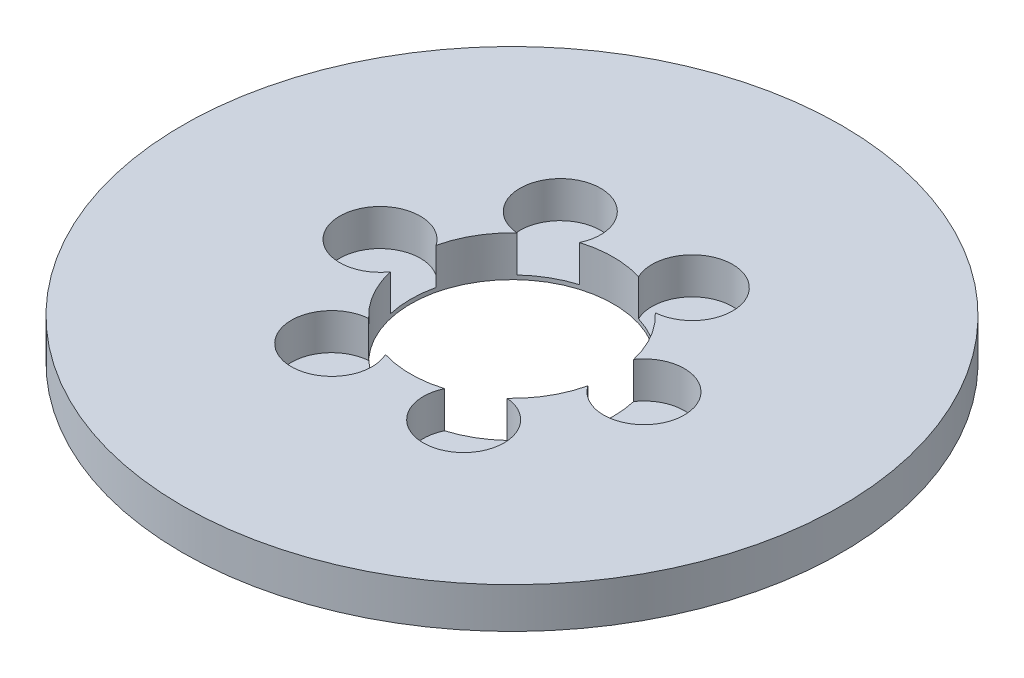
ISO-10303-21;
HEADER;
FILE_DESCRIPTION(('STEP AP214'),'2;1');
FILE_NAME('part.step','',(''),(''),'','','');
FILE_SCHEMA(('AUTOMOTIVE_DESIGN { 1 0 10303 214 1 1 1 1 }'));
ENDSEC;
DATA;
#1=APPLICATION_CONTEXT('core data for automotive mechanical design processes');
#2=APPLICATION_PROTOCOL_DEFINITION('international standard','automotive_design',2000,#1);
#3=PRODUCT_CONTEXT('',#1,'mechanical');
#4=PRODUCT('Part','Part','',(#3));
#5=PRODUCT_RELATED_PRODUCT_CATEGORY('part','',(#4));
#6=PRODUCT_DEFINITION_FORMATION('','',#4);
#7=PRODUCT_DEFINITION_CONTEXT('part definition',#1,'design');
#8=PRODUCT_DEFINITION('design','',#6,#7);
#9=PRODUCT_DEFINITION_SHAPE('','',#8);
#10=(LENGTH_UNIT() NAMED_UNIT(*) SI_UNIT(.MILLI.,.METRE.));
#11=(NAMED_UNIT(*) PLANE_ANGLE_UNIT() SI_UNIT($,.RADIAN.));
#12=(NAMED_UNIT(*) SI_UNIT($,.STERADIAN.) SOLID_ANGLE_UNIT());
#13=UNCERTAINTY_MEASURE_WITH_UNIT(LENGTH_MEASURE(1.E-05),#10,'distance_accuracy_value','');
#14=(GEOMETRIC_REPRESENTATION_CONTEXT(3) GLOBAL_UNCERTAINTY_ASSIGNED_CONTEXT((#13)) GLOBAL_UNIT_ASSIGNED_CONTEXT((#10,
#11,#12)) REPRESENTATION_CONTEXT('',''));
#15=CARTESIAN_POINT('',(0.,0.,0.));
#16=DIRECTION('',(0.,0.,1.));
#17=DIRECTION('',(1.,0.,0.));
#18=AXIS2_PLACEMENT_3D('',#15,#16,#17);
#19=CARTESIAN_POINT('',(0.,4.,0.));
#20=DIRECTION('',(0.,-1.,0.));
#21=DIRECTION('',(0.,0.,-1.));
#22=AXIS2_PLACEMENT_3D('',#19,#20,#21);
#23=CYLINDRICAL_SURFACE('',#22,32.5);
#24=CARTESIAN_POINT('',(0.,4.,0.));
#25=DIRECTION('',(0.,1.,0.));
#26=DIRECTION('',(0.,0.,1.));
#27=AXIS2_PLACEMENT_3D('',#24,#25,#26);
#28=CIRCLE('',#27,32.5);
#29=CARTESIAN_POINT('',(0.,4.,32.5));
#30=VERTEX_POINT('',#29);
#31=EDGE_CURVE('E171',#30,#30,#28,.T.);
#32=ORIENTED_EDGE('',*,*,#31,.F.);
#33=EDGE_LOOP('',(#32));
#34=FACE_BOUND('',#33,.T.);
#35=CARTESIAN_POINT('',(0.,0.,0.));
#36=DIRECTION('',(0.,1.,0.));
#37=DIRECTION('',(0.,0.,1.));
#38=AXIS2_PLACEMENT_3D('',#35,#36,#37);
#39=CIRCLE('',#38,32.5);
#40=CARTESIAN_POINT('',(0.,0.,32.5));
#41=VERTEX_POINT('',#40);
#42=EDGE_CURVE('E157',#41,#41,#39,.T.);
#43=ORIENTED_EDGE('',*,*,#42,.T.);
#44=EDGE_LOOP('',(#43));
#45=FACE_BOUND('',#44,.T.);
#46=ADVANCED_FACE('F39',(#34,#45),#23,.T.);
#47=CARTESIAN_POINT('',(0.,4.,0.));
#48=DIRECTION('',(0.,1.,0.));
#49=DIRECTION('',(0.,0.,1.));
#50=AXIS2_PLACEMENT_3D('',#47,#48,#49);
#51=PLANE('',#50);
#52=CARTESIAN_POINT('',(-6.50778404196415,4.,-11.2718126053675));
#53=DIRECTION('',(0.,1.,0.));
#54=DIRECTION('',(-0.866025403784433,0.,0.50000000000001));
#55=AXIS2_PLACEMENT_3D('',#52,#53,#54);
#56=CIRCLE('',#55,3.97783235547569);
#57=CARTESIAN_POINT('',(-2.91430675576737,4.,-9.56591951321402));
#58=VERTEX_POINT('',#57);
#59=CARTESIAN_POINT('',(-6.8271759311171,4.,-7.306823441522));
#60=VERTEX_POINT('',#59);
#61=EDGE_CURVE('E214',#58,#60,#56,.T.);
#62=ORIENTED_EDGE('',*,*,#61,.F.);
#63=CARTESIAN_POINT('',(0.,4.,0.));
#64=DIRECTION('',(0.,1.,0.));
#65=DIRECTION('',(0.,0.,1.));
#66=AXIS2_PLACEMENT_3D('',#63,#64,#65);
#67=CIRCLE('',#66,10.);
#68=CARTESIAN_POINT('',(2.91430675576717,4.,-9.56591951321408));
#69=VERTEX_POINT('',#68);
#70=EDGE_CURVE('E272',#69,#58,#67,.T.);
#71=ORIENTED_EDGE('',*,*,#70,.F.);
#72=CARTESIAN_POINT('',(6.50778404196391,4.,-11.2718126053677));
#73=DIRECTION('',(0.,1.,0.));
#74=DIRECTION('',(-0.866025403784443,0.,-0.499999999999992));
#75=AXIS2_PLACEMENT_3D('',#72,#73,#74);
#76=CIRCLE('',#75,3.97783235547569);
#77=CARTESIAN_POINT('',(6.82717593111694,4.,-7.30682344152214));
#78=VERTEX_POINT('',#77);
#79=EDGE_CURVE('E285',#78,#69,#76,.T.);
#80=ORIENTED_EDGE('',*,*,#79,.F.);
#81=CARTESIAN_POINT('',(9.74148268688427,4.,-2.25909607169197));
#82=VERTEX_POINT('',#81);
#83=EDGE_CURVE('E165',#82,#78,#67,.T.);
#84=ORIENTED_EDGE('',*,*,#83,.F.);
#85=CARTESIAN_POINT('',(13.015568083928,4.,0.));
#86=DIRECTION('',(0.,1.,0.));
#87=DIRECTION('',(0.,0.,-1.));
#88=AXIS2_PLACEMENT_3D('',#85,#86,#87);
#89=CIRCLE('',#88,3.97783235547569);
#90=CARTESIAN_POINT('',(9.74148268688427,4.,2.25909607169197));
#91=VERTEX_POINT('',#90);
#92=EDGE_CURVE('E281',#91,#82,#89,.T.);
#93=ORIENTED_EDGE('',*,*,#92,.F.);
#94=CARTESIAN_POINT('',(6.82717593111704,4.,7.30682344152205));
#95=VERTEX_POINT('',#94);
#96=EDGE_CURVE('E160',#95,#91,#67,.T.);
#97=ORIENTED_EDGE('',*,*,#96,.F.);
#98=CARTESIAN_POINT('',(6.50778404196407,4.,11.2718126053676));
#99=DIRECTION('',(0.,1.,0.));
#100=DIRECTION('',(0.866025403784436,0.,-0.500000000000004));
#101=AXIS2_PLACEMENT_3D('',#98,#99,#100);
#102=CIRCLE('',#101,3.97783235547569);
#103=CARTESIAN_POINT('',(2.9143067557673,4.,9.56591951321404));
#104=VERTEX_POINT('',#103);
#105=EDGE_CURVE('E154',#104,#95,#102,.T.);
#106=ORIENTED_EDGE('',*,*,#105,.F.);
#107=CARTESIAN_POINT('',(-2.91430675576723,4.,9.56591951321406));
#108=VERTEX_POINT('',#107);
#109=EDGE_CURVE('E150',#108,#104,#67,.T.);
#110=ORIENTED_EDGE('',*,*,#109,.F.);
#111=CARTESIAN_POINT('',(-6.50778404196399,4.,11.2718126053676));
#112=DIRECTION('',(0.,1.,0.));
#113=DIRECTION('',(0.86602540378444,0.,0.499999999999998));
#114=AXIS2_PLACEMENT_3D('',#111,#112,#113);
#115=CIRCLE('',#114,3.97783235547569);
#116=CARTESIAN_POINT('',(-6.82717593111699,4.,7.3068234415221));
#117=VERTEX_POINT('',#116);
#118=EDGE_CURVE('E127',#117,#108,#115,.T.);
#119=ORIENTED_EDGE('',*,*,#118,.F.);
#120=CARTESIAN_POINT('',(-9.74148268688427,4.,2.25909607169197));
#121=VERTEX_POINT('',#120);
#122=EDGE_CURVE('E156',#121,#117,#67,.T.);
#123=ORIENTED_EDGE('',*,*,#122,.F.);
#124=CARTESIAN_POINT('',(-13.015568083928,4.,0.));
#125=DIRECTION('',(0.,1.,0.));
#126=DIRECTION('',(0.,0.,1.));
#127=AXIS2_PLACEMENT_3D('',#124,#125,#126);
#128=CIRCLE('',#127,3.97783235547569);
#129=CARTESIAN_POINT('',(-9.74148268688427,4.,-2.25909607169197));
#130=VERTEX_POINT('',#129);
#131=EDGE_CURVE('E164',#130,#121,#128,.T.);
#132=ORIENTED_EDGE('',*,*,#131,.F.);
#133=EDGE_CURVE('E159',#60,#130,#67,.T.);
#134=ORIENTED_EDGE('',*,*,#133,.F.);
#135=EDGE_LOOP('',(#62,#71,#80,#84,#93,#97,#106,#110,#119,#123,#132,#134));
#136=FACE_BOUND('',#135,.T.);
#137=ORIENTED_EDGE('',*,*,#31,.T.);
#138=EDGE_LOOP('',(#137));
#139=FACE_BOUND('',#138,.T.);
#140=ADVANCED_FACE('F155',(#136,#139),#51,.T.);
#141=CARTESIAN_POINT('',(0.,0.,0.));
#142=DIRECTION('',(0.,1.,0.));
#143=DIRECTION('',(0.,0.,1.));
#144=AXIS2_PLACEMENT_3D('',#141,#142,#143);
#145=PLANE('',#144);
#146=CARTESIAN_POINT('',(0.,0.,0.));
#147=DIRECTION('',(0.,1.,0.));
#148=DIRECTION('',(0.,0.,1.));
#149=AXIS2_PLACEMENT_3D('',#146,#147,#148);
#150=CIRCLE('',#149,10.);
#151=CARTESIAN_POINT('',(0.,0.,10.));
#152=VERTEX_POINT('',#151);
#153=EDGE_CURVE('E170',#152,#152,#150,.T.);
#154=ORIENTED_EDGE('',*,*,#153,.T.);
#155=EDGE_LOOP('',(#154));
#156=FACE_BOUND('',#155,.T.);
#157=ORIENTED_EDGE('',*,*,#42,.F.);
#158=EDGE_LOOP('',(#157));
#159=FACE_BOUND('',#158,.T.);
#160=ADVANCED_FACE('F232',(#156,#159),#145,.F.);
#161=CARTESIAN_POINT('',(0.,4.,0.));
#162=DIRECTION('',(0.,-1.,0.));
#163=DIRECTION('',(0.,0.,-1.));
#164=AXIS2_PLACEMENT_3D('',#161,#162,#163);
#165=CYLINDRICAL_SURFACE('',#164,10.);
#166=DIRECTION('',(0.,1.,0.));
#167=VECTOR('',#166,1.);
#168=CARTESIAN_POINT('',(-2.91430675576737,2.20142956148121,-9.56591951321402));
#169=LINE('',#168,#167);
#170=CARTESIAN_POINT('',(-2.91430675576737,0.402859122962412,-9.56591951321402));
#171=VERTEX_POINT('',#170);
#172=EDGE_CURVE('E11',#171,#58,#169,.T.);
#173=ORIENTED_EDGE('',*,*,#172,.F.);
#174=CARTESIAN_POINT('',(0.,0.402859122962412,0.));
#175=DIRECTION('',(0.,1.,0.));
#176=DIRECTION('',(0.,0.,1.));
#177=AXIS2_PLACEMENT_3D('',#174,#175,#176);
#178=CIRCLE('',#177,10.);
#179=CARTESIAN_POINT('',(-6.8271759311171,0.402859122962412,-7.306823441522));
#180=VERTEX_POINT('',#179);
#181=EDGE_CURVE('E209',#171,#180,#178,.T.);
#182=ORIENTED_EDGE('',*,*,#181,.T.);
#183=DIRECTION('',(0.,1.,0.));
#184=VECTOR('',#183,1.);
#185=CARTESIAN_POINT('',(-6.82717593111709,2.20142956148121,-7.306823441522));
#186=LINE('',#185,#184);
#187=EDGE_CURVE('E46',#60,#180,#186,.F.);
#188=ORIENTED_EDGE('',*,*,#187,.F.);
#189=ORIENTED_EDGE('',*,*,#133,.T.);
#190=DIRECTION('',(0.,1.,0.));
#191=VECTOR('',#190,1.);
#192=CARTESIAN_POINT('',(-9.74148268688427,2.20142956148121,-2.25909607169197));
#193=LINE('',#192,#191);
#194=CARTESIAN_POINT('',(-9.74148268688427,0.402859122962412,-2.25909607169197));
#195=VERTEX_POINT('',#194);
#196=EDGE_CURVE('E185',#195,#130,#193,.T.);
#197=ORIENTED_EDGE('',*,*,#196,.F.);
#198=CARTESIAN_POINT('',(0.,0.402859122962412,0.));
#199=DIRECTION('',(0.,1.,0.));
#200=DIRECTION('',(0.,0.,1.));
#201=AXIS2_PLACEMENT_3D('',#198,#199,#200);
#202=CIRCLE('',#201,10.);
#203=CARTESIAN_POINT('',(-9.74148268688427,0.402859122962412,2.25909607169197));
#204=VERTEX_POINT('',#203);
#205=EDGE_CURVE('E173',#195,#204,#202,.T.);
#206=ORIENTED_EDGE('',*,*,#205,.T.);
#207=DIRECTION('',(0.,1.,0.));
#208=VECTOR('',#207,1.);
#209=CARTESIAN_POINT('',(-9.74148268688427,2.20142956148121,2.25909607169197));
#210=LINE('',#209,#208);
#211=EDGE_CURVE('E178',#121,#204,#210,.F.);
#212=ORIENTED_EDGE('',*,*,#211,.F.);
#213=ORIENTED_EDGE('',*,*,#122,.T.);
#214=DIRECTION('',(0.,1.,0.));
#215=VECTOR('',#214,1.);
#216=CARTESIAN_POINT('',(-6.82717593111699,2.20142956148121,7.3068234415221));
#217=LINE('',#216,#215);
#218=CARTESIAN_POINT('',(-6.82717593111699,0.402859122962412,7.3068234415221));
#219=VERTEX_POINT('',#218);
#220=EDGE_CURVE('E132',#219,#117,#217,.T.);
#221=ORIENTED_EDGE('',*,*,#220,.F.);
#222=CARTESIAN_POINT('',(0.,0.402859122962412,0.));
#223=DIRECTION('',(0.,1.,0.));
#224=DIRECTION('',(0.,0.,1.));
#225=AXIS2_PLACEMENT_3D('',#222,#223,#224);
#226=CIRCLE('',#225,10.);
#227=CARTESIAN_POINT('',(-2.91430675576723,0.402859122962412,9.56591951321406));
#228=VERTEX_POINT('',#227);
#229=EDGE_CURVE('E146',#219,#228,#226,.T.);
#230=ORIENTED_EDGE('',*,*,#229,.T.);
#231=DIRECTION('',(0.,1.,0.));
#232=VECTOR('',#231,1.);
#233=CARTESIAN_POINT('',(-2.91430675576723,2.20142956148121,9.56591951321406));
#234=LINE('',#233,#232);
#235=EDGE_CURVE('E128',#108,#228,#234,.F.);
#236=ORIENTED_EDGE('',*,*,#235,.F.);
#237=ORIENTED_EDGE('',*,*,#109,.T.);
#238=DIRECTION('',(0.,1.,0.));
#239=VECTOR('',#238,1.);
#240=CARTESIAN_POINT('',(2.9143067557673,2.20142956148121,9.56591951321404));
#241=LINE('',#240,#239);
#242=CARTESIAN_POINT('',(2.9143067557673,0.402859122962412,9.56591951321404));
#243=VERTEX_POINT('',#242);
#244=EDGE_CURVE('E192',#243,#104,#241,.T.);
#245=ORIENTED_EDGE('',*,*,#244,.F.);
#246=CARTESIAN_POINT('',(0.,0.402859122962412,0.));
#247=DIRECTION('',(0.,1.,0.));
#248=DIRECTION('',(0.,0.,1.));
#249=AXIS2_PLACEMENT_3D('',#246,#247,#248);
#250=CIRCLE('',#249,10.);
#251=CARTESIAN_POINT('',(6.82717593111704,0.402859122962412,7.30682344152205));
#252=VERTEX_POINT('',#251);
#253=EDGE_CURVE('E190',#243,#252,#250,.T.);
#254=ORIENTED_EDGE('',*,*,#253,.T.);
#255=DIRECTION('',(0.,1.,0.));
#256=VECTOR('',#255,1.);
#257=CARTESIAN_POINT('',(6.82717593111704,2.20142956148121,7.30682344152205));
#258=LINE('',#257,#256);
#259=EDGE_CURVE('E189',#95,#252,#258,.F.);
#260=ORIENTED_EDGE('',*,*,#259,.F.);
#261=ORIENTED_EDGE('',*,*,#96,.T.);
#262=DIRECTION('',(0.,1.,0.));
#263=VECTOR('',#262,1.);
#264=CARTESIAN_POINT('',(9.74148268688427,2.20142956148121,2.25909607169197));
#265=LINE('',#264,#263);
#266=CARTESIAN_POINT('',(9.74148268688427,0.402859122962412,2.25909607169197));
#267=VERTEX_POINT('',#266);
#268=EDGE_CURVE('E203',#267,#91,#265,.T.);
#269=ORIENTED_EDGE('',*,*,#268,.F.);
#270=CARTESIAN_POINT('',(0.,0.402859122962412,0.));
#271=DIRECTION('',(0.,1.,0.));
#272=DIRECTION('',(0.,0.,1.));
#273=AXIS2_PLACEMENT_3D('',#270,#271,#272);
#274=CIRCLE('',#273,10.);
#275=CARTESIAN_POINT('',(9.74148268688427,0.402859122962412,-2.25909607169197));
#276=VERTEX_POINT('',#275);
#277=EDGE_CURVE('E194',#267,#276,#274,.T.);
#278=ORIENTED_EDGE('',*,*,#277,.T.);
#279=DIRECTION('',(0.,1.,0.));
#280=VECTOR('',#279,1.);
#281=CARTESIAN_POINT('',(9.74148268688427,2.20142956148121,-2.25909607169197));
#282=LINE('',#281,#280);
#283=EDGE_CURVE('E196',#82,#276,#282,.F.);
#284=ORIENTED_EDGE('',*,*,#283,.F.);
#285=ORIENTED_EDGE('',*,*,#83,.T.);
#286=DIRECTION('',(0.,1.,0.));
#287=VECTOR('',#286,1.);
#288=CARTESIAN_POINT('',(6.82717593111694,2.20142956148121,-7.30682344152214));
#289=LINE('',#288,#287);
#290=CARTESIAN_POINT('',(6.82717593111694,0.402859122962412,-7.30682344152214));
#291=VERTEX_POINT('',#290);
#292=EDGE_CURVE('E208',#291,#78,#289,.T.);
#293=ORIENTED_EDGE('',*,*,#292,.F.);
#294=CARTESIAN_POINT('',(0.,0.402859122962412,0.));
#295=DIRECTION('',(0.,1.,0.));
#296=DIRECTION('',(0.,0.,1.));
#297=AXIS2_PLACEMENT_3D('',#294,#295,#296);
#298=CIRCLE('',#297,10.);
#299=CARTESIAN_POINT('',(2.91430675576717,0.402859122962412,-9.56591951321408));
#300=VERTEX_POINT('',#299);
#301=EDGE_CURVE('E201',#291,#300,#298,.T.);
#302=ORIENTED_EDGE('',*,*,#301,.T.);
#303=DIRECTION('',(0.,1.,0.));
#304=VECTOR('',#303,1.);
#305=CARTESIAN_POINT('',(2.91430675576717,2.20142956148121,-9.56591951321408));
#306=LINE('',#305,#304);
#307=EDGE_CURVE('E206',#69,#300,#306,.F.);
#308=ORIENTED_EDGE('',*,*,#307,.F.);
#309=ORIENTED_EDGE('',*,*,#70,.T.);
#310=EDGE_LOOP('',(#173,#182,#188,#189,#197,#206,#212,#213,#221,#230,#236,#237,#245,#254,#260,
#261,#269,#278,#284,#285,#293,#302,#308,#309));
#311=FACE_BOUND('',#310,.T.);
#312=ORIENTED_EDGE('',*,*,#153,.F.);
#313=EDGE_LOOP('',(#312));
#314=FACE_BOUND('',#313,.T.);
#315=ADVANCED_FACE('F145',(#311,#314),#165,.F.);
#316=CARTESIAN_POINT('',(-13.015568083928,0.402859122962412,0.));
#317=DIRECTION('',(0.,1.,0.));
#318=DIRECTION('',(0.,0.,1.));
#319=AXIS2_PLACEMENT_3D('',#316,#317,#318);
#320=CYLINDRICAL_SURFACE('',#319,3.97783235547569);
#321=ORIENTED_EDGE('',*,*,#196,.T.);
#322=ORIENTED_EDGE('',*,*,#131,.T.);
#323=ORIENTED_EDGE('',*,*,#211,.T.);
#324=CARTESIAN_POINT('',(-13.015568083928,0.402859122962412,0.));
#325=DIRECTION('',(0.,1.,0.));
#326=DIRECTION('',(0.,0.,1.));
#327=AXIS2_PLACEMENT_3D('',#324,#325,#326);
#328=CIRCLE('',#327,3.97783235547569);
#329=EDGE_CURVE('E168',#195,#204,#328,.T.);
#330=ORIENTED_EDGE('',*,*,#329,.F.);
#331=EDGE_LOOP('',(#321,#322,#323,#330));
#332=FACE_BOUND('',#331,.T.);
#333=ADVANCED_FACE('F243',(#332),#320,.F.);
#334=CARTESIAN_POINT('',(-13.015568083928,0.402859122962412,0.));
#335=DIRECTION('',(0.,1.,0.));
#336=DIRECTION('',(0.,0.,1.));
#337=AXIS2_PLACEMENT_3D('',#334,#335,#336);
#338=PLANE('',#337);
#339=ORIENTED_EDGE('',*,*,#329,.T.);
#340=ORIENTED_EDGE('',*,*,#205,.F.);
#341=EDGE_LOOP('',(#339,#340));
#342=FACE_BOUND('',#341,.T.);
#343=ADVANCED_FACE('F247',(#342),#338,.T.);
#344=CARTESIAN_POINT('',(-6.50778404196399,0.402859122962412,11.2718126053676));
#345=DIRECTION('',(0.,1.,0.));
#346=DIRECTION('',(0.,0.,1.));
#347=AXIS2_PLACEMENT_3D('',#344,#345,#346);
#348=CYLINDRICAL_SURFACE('',#347,3.97783235547569);
#349=ORIENTED_EDGE('',*,*,#220,.T.);
#350=ORIENTED_EDGE('',*,*,#118,.T.);
#351=ORIENTED_EDGE('',*,*,#235,.T.);
#352=CARTESIAN_POINT('',(-6.50778404196399,0.402859122962412,11.2718126053676));
#353=DIRECTION('',(0.,1.,0.));
#354=DIRECTION('',(0.86602540378444,0.,0.499999999999998));
#355=AXIS2_PLACEMENT_3D('',#352,#353,#354);
#356=CIRCLE('',#355,3.97783235547569);
#357=EDGE_CURVE('E137',#219,#228,#356,.T.);
#358=ORIENTED_EDGE('',*,*,#357,.F.);
#359=EDGE_LOOP('',(#349,#350,#351,#358));
#360=FACE_BOUND('',#359,.T.);
#361=ADVANCED_FACE('F126',(#360),#348,.F.);
#362=CARTESIAN_POINT('',(-6.50778404196399,0.402859122962412,11.2718126053676));
#363=DIRECTION('',(0.,1.,0.));
#364=DIRECTION('',(0.86602540378444,0.,0.499999999999998));
#365=AXIS2_PLACEMENT_3D('',#362,#363,#364);
#366=PLANE('',#365);
#367=ORIENTED_EDGE('',*,*,#357,.T.);
#368=ORIENTED_EDGE('',*,*,#229,.F.);
#369=EDGE_LOOP('',(#367,#368));
#370=FACE_BOUND('',#369,.T.);
#371=ADVANCED_FACE('F254',(#370),#366,.T.);
#372=CARTESIAN_POINT('',(6.50778404196407,0.402859122962412,11.2718126053676));
#373=DIRECTION('',(0.,1.,0.));
#374=DIRECTION('',(0.,0.,1.));
#375=AXIS2_PLACEMENT_3D('',#372,#373,#374);
#376=CYLINDRICAL_SURFACE('',#375,3.97783235547569);
#377=ORIENTED_EDGE('',*,*,#244,.T.);
#378=ORIENTED_EDGE('',*,*,#105,.T.);
#379=ORIENTED_EDGE('',*,*,#259,.T.);
#380=CARTESIAN_POINT('',(6.50778404196407,0.402859122962412,11.2718126053676));
#381=DIRECTION('',(0.,1.,0.));
#382=DIRECTION('',(0.866025403784436,0.,-0.500000000000004));
#383=AXIS2_PLACEMENT_3D('',#380,#381,#382);
#384=CIRCLE('',#383,3.97783235547569);
#385=EDGE_CURVE('E138',#243,#252,#384,.T.);
#386=ORIENTED_EDGE('',*,*,#385,.F.);
#387=EDGE_LOOP('',(#377,#378,#379,#386));
#388=FACE_BOUND('',#387,.T.);
#389=ADVANCED_FACE('F260',(#388),#376,.F.);
#390=CARTESIAN_POINT('',(6.50778404196407,0.402859122962412,11.2718126053676));
#391=DIRECTION('',(0.,1.,0.));
#392=DIRECTION('',(0.866025403784436,0.,-0.500000000000004));
#393=AXIS2_PLACEMENT_3D('',#390,#391,#392);
#394=PLANE('',#393);
#395=ORIENTED_EDGE('',*,*,#385,.T.);
#396=ORIENTED_EDGE('',*,*,#253,.F.);
#397=EDGE_LOOP('',(#395,#396));
#398=FACE_BOUND('',#397,.T.);
#399=ADVANCED_FACE('F265',(#398),#394,.T.);
#400=CARTESIAN_POINT('',(13.015568083928,0.402859122962412,0.));
#401=DIRECTION('',(0.,1.,0.));
#402=DIRECTION('',(0.,0.,1.));
#403=AXIS2_PLACEMENT_3D('',#400,#401,#402);
#404=CYLINDRICAL_SURFACE('',#403,3.97783235547569);
#405=ORIENTED_EDGE('',*,*,#268,.T.);
#406=ORIENTED_EDGE('',*,*,#92,.T.);
#407=ORIENTED_EDGE('',*,*,#283,.T.);
#408=CARTESIAN_POINT('',(13.015568083928,0.402859122962412,0.));
#409=DIRECTION('',(0.,1.,0.));
#410=DIRECTION('',(0.,0.,-1.));
#411=AXIS2_PLACEMENT_3D('',#408,#409,#410);
#412=CIRCLE('',#411,3.97783235547569);
#413=EDGE_CURVE('E287',#267,#276,#412,.T.);
#414=ORIENTED_EDGE('',*,*,#413,.F.);
#415=EDGE_LOOP('',(#405,#406,#407,#414));
#416=FACE_BOUND('',#415,.T.);
#417=ADVANCED_FACE('F300',(#416),#404,.F.);
#418=CARTESIAN_POINT('',(13.015568083928,0.402859122962412,0.));
#419=DIRECTION('',(0.,1.,0.));
#420=DIRECTION('',(0.,0.,-1.));
#421=AXIS2_PLACEMENT_3D('',#418,#419,#420);
#422=PLANE('',#421);
#423=ORIENTED_EDGE('',*,*,#413,.T.);
#424=ORIENTED_EDGE('',*,*,#277,.F.);
#425=EDGE_LOOP('',(#423,#424));
#426=FACE_BOUND('',#425,.T.);
#427=ADVANCED_FACE('F298',(#426),#422,.T.);
#428=CARTESIAN_POINT('',(6.50778404196391,0.402859122962412,-11.2718126053677));
#429=DIRECTION('',(0.,1.,0.));
#430=DIRECTION('',(0.,0.,1.));
#431=AXIS2_PLACEMENT_3D('',#428,#429,#430);
#432=CYLINDRICAL_SURFACE('',#431,3.97783235547569);
#433=ORIENTED_EDGE('',*,*,#292,.T.);
#434=ORIENTED_EDGE('',*,*,#79,.T.);
#435=ORIENTED_EDGE('',*,*,#307,.T.);
#436=CARTESIAN_POINT('',(6.50778404196391,0.402859122962412,-11.2718126053677));
#437=DIRECTION('',(0.,1.,0.));
#438=DIRECTION('',(-0.866025403784443,0.,-0.499999999999992));
#439=AXIS2_PLACEMENT_3D('',#436,#437,#438);
#440=CIRCLE('',#439,3.97783235547569);
#441=EDGE_CURVE('E56',#291,#300,#440,.T.);
#442=ORIENTED_EDGE('',*,*,#441,.F.);
#443=EDGE_LOOP('',(#433,#434,#435,#442));
#444=FACE_BOUND('',#443,.T.);
#445=ADVANCED_FACE('F301',(#444),#432,.F.);
#446=CARTESIAN_POINT('',(6.50778404196391,0.402859122962412,-11.2718126053677));
#447=DIRECTION('',(0.,1.,0.));
#448=DIRECTION('',(-0.866025403784443,0.,-0.499999999999992));
#449=AXIS2_PLACEMENT_3D('',#446,#447,#448);
#450=PLANE('',#449);
#451=ORIENTED_EDGE('',*,*,#441,.T.);
#452=ORIENTED_EDGE('',*,*,#301,.F.);
#453=EDGE_LOOP('',(#451,#452));
#454=FACE_BOUND('',#453,.T.);
#455=ADVANCED_FACE('F221',(#454),#450,.T.);
#456=CARTESIAN_POINT('',(-6.50778404196415,0.402859122962412,-11.2718126053675));
#457=DIRECTION('',(0.,1.,0.));
#458=DIRECTION('',(0.,0.,1.));
#459=AXIS2_PLACEMENT_3D('',#456,#457,#458);
#460=CYLINDRICAL_SURFACE('',#459,3.97783235547569);
#461=ORIENTED_EDGE('',*,*,#172,.T.);
#462=ORIENTED_EDGE('',*,*,#61,.T.);
#463=ORIENTED_EDGE('',*,*,#187,.T.);
#464=CARTESIAN_POINT('',(-6.50778404196415,0.402859122962412,-11.2718126053675));
#465=DIRECTION('',(0.,1.,0.));
#466=DIRECTION('',(-0.866025403784433,0.,0.50000000000001));
#467=AXIS2_PLACEMENT_3D('',#464,#465,#466);
#468=CIRCLE('',#467,3.97783235547569);
#469=EDGE_CURVE('E55',#171,#180,#468,.T.);
#470=ORIENTED_EDGE('',*,*,#469,.F.);
#471=EDGE_LOOP('',(#461,#462,#463,#470));
#472=FACE_BOUND('',#471,.T.);
#473=ADVANCED_FACE('F212',(#472),#460,.F.);
#474=CARTESIAN_POINT('',(-6.50778404196415,0.402859122962412,-11.2718126053675));
#475=DIRECTION('',(0.,1.,0.));
#476=DIRECTION('',(-0.866025403784433,0.,0.50000000000001));
#477=AXIS2_PLACEMENT_3D('',#474,#475,#476);
#478=PLANE('',#477);
#479=ORIENTED_EDGE('',*,*,#469,.T.);
#480=ORIENTED_EDGE('',*,*,#181,.F.);
#481=EDGE_LOOP('',(#479,#480));
#482=FACE_BOUND('',#481,.T.);
#483=ADVANCED_FACE('F217',(#482),#478,.T.);
#484=CLOSED_SHELL('',(#46,#140,#160,#315,#333,#343,#361,#371,#389,#399,#417,#427,#445,#455,#473,#483));
#485=MANIFOLD_SOLID_BREP('B2',#484);
#486=ADVANCED_BREP_SHAPE_REPRESENTATION('',(#18,#485),#14);
#487=SHAPE_DEFINITION_REPRESENTATION(#9,#486);
ENDSEC;
END-ISO-10303-21;
